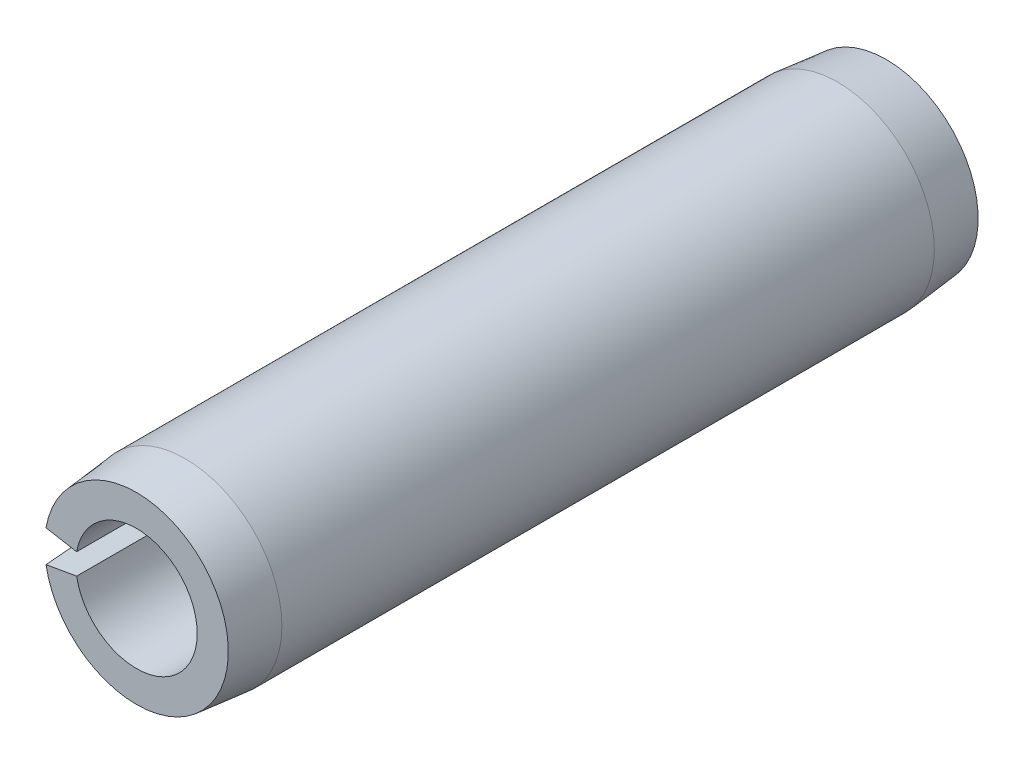
ISO-10303-21;
HEADER;
FILE_DESCRIPTION(('STEP AP214'),'2;1');
FILE_NAME('part.step','',(''),(''),'','','');
FILE_SCHEMA(('AUTOMOTIVE_DESIGN { 1 0 10303 214 1 1 1 1 }'));
ENDSEC;
DATA;
#1=APPLICATION_CONTEXT('core data for automotive mechanical design processes');
#2=APPLICATION_PROTOCOL_DEFINITION('international standard','automotive_design',2000,#1);
#3=PRODUCT_CONTEXT('',#1,'mechanical');
#4=PRODUCT('Part','Part','',(#3));
#5=PRODUCT_RELATED_PRODUCT_CATEGORY('part','',(#4));
#6=PRODUCT_DEFINITION_FORMATION('','',#4);
#7=PRODUCT_DEFINITION_CONTEXT('part definition',#1,'design');
#8=PRODUCT_DEFINITION('design','',#6,#7);
#9=PRODUCT_DEFINITION_SHAPE('','',#8);
#10=(LENGTH_UNIT() NAMED_UNIT(*) SI_UNIT(.MILLI.,.METRE.));
#11=(NAMED_UNIT(*) PLANE_ANGLE_UNIT() SI_UNIT($,.RADIAN.));
#12=(NAMED_UNIT(*) SI_UNIT($,.STERADIAN.) SOLID_ANGLE_UNIT());
#13=UNCERTAINTY_MEASURE_WITH_UNIT(LENGTH_MEASURE(1.E-05),#10,'distance_accuracy_value','');
#14=(GEOMETRIC_REPRESENTATION_CONTEXT(3) GLOBAL_UNCERTAINTY_ASSIGNED_CONTEXT((#13)) GLOBAL_UNIT_ASSIGNED_CONTEXT((#10,
#11,#12)) REPRESENTATION_CONTEXT('',''));
#15=CARTESIAN_POINT('',(0.,0.,0.));
#16=DIRECTION('',(0.,0.,1.));
#17=DIRECTION('',(1.,0.,0.));
#18=AXIS2_PLACEMENT_3D('',#15,#16,#17);
#19=CARTESIAN_POINT('',(0.,0.,12.7));
#20=DIRECTION('',(0.,0.,-1.));
#21=DIRECTION('',(-1.,0.,0.));
#22=AXIS2_PLACEMENT_3D('',#19,#20,#21);
#23=CYLINDRICAL_SURFACE('',#22,2.0574);
#24=CARTESIAN_POINT('',(0.,0.,-12.7));
#25=DIRECTION('',(0.,0.,-1.));
#26=DIRECTION('',(1.,0.,0.));
#27=AXIS2_PLACEMENT_3D('',#24,#25,#26);
#28=CIRCLE('',#27,2.0574);
#29=CARTESIAN_POINT('',(-2.02614347104732,0.357263760731936,-12.7));
#30=VERTEX_POINT('',#29);
#31=CARTESIAN_POINT('',(-2.02614347104732,-0.357263760731936,-12.7));
#32=VERTEX_POINT('',#31);
#33=EDGE_CURVE('E115',#30,#32,#28,.T.);
#34=ORIENTED_EDGE('',*,*,#33,.T.);
#35=DIRECTION('',(0.,0.,-1.));
#36=VECTOR('',#35,1.);
#37=CARTESIAN_POINT('',(-2.02614347104732,-0.357263760731936,12.7));
#38=LINE('',#37,#36);
#39=CARTESIAN_POINT('',(-2.02614347104732,-0.357263760731936,12.7));
#40=VERTEX_POINT('',#39);
#41=EDGE_CURVE('E11',#40,#32,#38,.T.);
#42=ORIENTED_EDGE('',*,*,#41,.F.);
#43=CARTESIAN_POINT('',(0.,0.,12.7));
#44=DIRECTION('',(0.,0.,-1.));
#45=DIRECTION('',(1.,0.,0.));
#46=AXIS2_PLACEMENT_3D('',#43,#44,#45);
#47=CIRCLE('',#46,2.0574);
#48=CARTESIAN_POINT('',(-2.02614347104732,0.357263760731936,12.7));
#49=VERTEX_POINT('',#48);
#50=EDGE_CURVE('E111',#49,#40,#47,.T.);
#51=ORIENTED_EDGE('',*,*,#50,.F.);
#52=DIRECTION('',(0.,0.,-1.));
#53=VECTOR('',#52,1.);
#54=CARTESIAN_POINT('',(-2.02614347104732,0.357263760731936,12.7));
#55=LINE('',#54,#53);
#56=EDGE_CURVE('E104',#49,#30,#55,.T.);
#57=ORIENTED_EDGE('',*,*,#56,.T.);
#58=EDGE_LOOP('',(#34,#42,#51,#57));
#59=FACE_BOUND('',#58,.T.);
#60=ADVANCED_FACE('F32',(#59),#23,.F.);
#61=CARTESIAN_POINT('',(-2.02614347104732,-0.357263760731936,12.7));
#62=DIRECTION('',(0.173648177666928,-0.984807753012209,0.));
#63=DIRECTION('',(0.984807753012209,0.173648177666928,0.));
#64=AXIS2_PLACEMENT_3D('',#61,#62,#63);
#65=PLANE('',#64);
#66=DIRECTION('',(0.,0.,-1.));
#67=VECTOR('',#66,1.);
#68=CARTESIAN_POINT('',(-3.2268210835198,-0.568975618943453,12.7));
#69=LINE('',#68,#67);
#70=CARTESIAN_POINT('',(-3.22682108351981,-0.568975618943454,11.049));
#71=VERTEX_POINT('',#70);
#72=CARTESIAN_POINT('',(-3.22682108351981,-0.568975618943454,-11.049));
#73=VERTEX_POINT('',#72);
#74=EDGE_CURVE('E39',#71,#73,#69,.T.);
#75=ORIENTED_EDGE('',*,*,#74,.F.);
#76=DIRECTION('',(-0.0979920339454284,-0.0172786394790785,-0.995037190209989));
#77=VECTOR('',#76,1.);
#78=CARTESIAN_POINT('',(0.,0.,43.8149999999999));
#79=LINE('',#78,#77);
#80=CARTESIAN_POINT('',(-3.06422932349749,-0.540306304810645,12.7));
#81=VERTEX_POINT('',#80);
#82=EDGE_CURVE('E86',#71,#81,#79,.F.);
#83=ORIENTED_EDGE('',*,*,#82,.T.);
#84=DIRECTION('',(-0.984807753012209,-0.173648177666928,0.));
#85=VECTOR('',#84,1.);
#86=CARTESIAN_POINT('',(-2.02614347104732,-0.357263760731936,12.7));
#87=LINE('',#86,#85);
#88=EDGE_CURVE('E119',#40,#81,#87,.T.);
#89=ORIENTED_EDGE('',*,*,#88,.F.);
#90=ORIENTED_EDGE('',*,*,#41,.T.);
#91=DIRECTION('',(-0.984807753012209,-0.173648177666928,0.));
#92=VECTOR('',#91,1.);
#93=CARTESIAN_POINT('',(-2.02614347104732,-0.357263760731936,-12.7));
#94=LINE('',#93,#92);
#95=CARTESIAN_POINT('',(-3.06422932349749,-0.540306304810645,-12.7));
#96=VERTEX_POINT('',#95);
#97=EDGE_CURVE('E112',#32,#96,#94,.T.);
#98=ORIENTED_EDGE('',*,*,#97,.T.);
#99=DIRECTION('',(0.0979920339454284,0.0172786394790785,-0.995037190209989));
#100=VECTOR('',#99,1.);
#101=CARTESIAN_POINT('',(0.,0.,-43.8149999999999));
#102=LINE('',#101,#100);
#103=EDGE_CURVE('E54',#96,#73,#102,.F.);
#104=ORIENTED_EDGE('',*,*,#103,.T.);
#105=EDGE_LOOP('',(#75,#83,#89,#90,#98,#104));
#106=FACE_BOUND('',#105,.T.);
#107=ADVANCED_FACE('F133',(#106),#65,.F.);
#108=CARTESIAN_POINT('',(0.,0.,12.7));
#109=DIRECTION('',(0.,0.,-1.));
#110=DIRECTION('',(-1.,0.,0.));
#111=AXIS2_PLACEMENT_3D('',#108,#109,#110);
#112=CYLINDRICAL_SURFACE('',#111,3.2766);
#113=DIRECTION('',(0.,0.,-1.));
#114=VECTOR('',#113,1.);
#115=CARTESIAN_POINT('',(-3.2268210835198,0.568975618943454,12.7));
#116=LINE('',#115,#114);
#117=CARTESIAN_POINT('',(-3.22682108351981,0.568975618943455,11.049));
#118=VERTEX_POINT('',#117);
#119=CARTESIAN_POINT('',(-3.22682108351981,0.568975618943455,-11.049));
#120=VERTEX_POINT('',#119);
#121=EDGE_CURVE('E96',#118,#120,#116,.T.);
#122=ORIENTED_EDGE('',*,*,#121,.F.);
#123=CARTESIAN_POINT('',(0.,0.,11.049));
#124=DIRECTION('',(0.,0.,-1.));
#125=DIRECTION('',(-1.,0.,0.));
#126=AXIS2_PLACEMENT_3D('',#123,#124,#125);
#127=CIRCLE('',#126,3.2766);
#128=EDGE_CURVE('E83',#118,#71,#127,.T.);
#129=ORIENTED_EDGE('',*,*,#128,.T.);
#130=ORIENTED_EDGE('',*,*,#74,.T.);
#131=CARTESIAN_POINT('',(0.,0.,-11.049));
#132=DIRECTION('',(0.,0.,-1.));
#133=DIRECTION('',(-1.,0.,0.));
#134=AXIS2_PLACEMENT_3D('',#131,#132,#133);
#135=CIRCLE('',#134,3.2766);
#136=EDGE_CURVE('E103',#120,#73,#135,.T.);
#137=ORIENTED_EDGE('',*,*,#136,.F.);
#138=EDGE_LOOP('',(#122,#129,#130,#137));
#139=FACE_BOUND('',#138,.T.);
#140=ADVANCED_FACE('F102',(#139),#112,.T.);
#141=CARTESIAN_POINT('',(-3.2268210835198,0.568975618943454,12.7));
#142=DIRECTION('',(0.173648177666928,0.984807753012209,0.));
#143=DIRECTION('',(-0.984807753012209,0.173648177666928,0.));
#144=AXIS2_PLACEMENT_3D('',#141,#142,#143);
#145=PLANE('',#144);
#146=DIRECTION('',(0.984807753012209,-0.173648177666928,0.));
#147=VECTOR('',#146,1.);
#148=CARTESIAN_POINT('',(-3.2268210835198,0.568975618943454,12.7));
#149=LINE('',#148,#147);
#150=CARTESIAN_POINT('',(-3.06422932349749,0.540306304810645,12.7));
#151=VERTEX_POINT('',#150);
#152=EDGE_CURVE('E99',#151,#49,#149,.T.);
#153=ORIENTED_EDGE('',*,*,#152,.F.);
#154=DIRECTION('',(0.0979920339454284,-0.0172786394790785,0.995037190209989));
#155=VECTOR('',#154,1.);
#156=CARTESIAN_POINT('',(0.,0.,43.8149999999999));
#157=LINE('',#156,#155);
#158=EDGE_CURVE('E46',#151,#118,#157,.F.);
#159=ORIENTED_EDGE('',*,*,#158,.T.);
#160=ORIENTED_EDGE('',*,*,#121,.T.);
#161=DIRECTION('',(-0.0979920339454284,0.0172786394790785,0.995037190209989));
#162=VECTOR('',#161,1.);
#163=CARTESIAN_POINT('',(0.,0.,-43.8149999999999));
#164=LINE('',#163,#162);
#165=CARTESIAN_POINT('',(-3.06422932349749,0.540306304810645,-12.7));
#166=VERTEX_POINT('',#165);
#167=EDGE_CURVE('E125',#120,#166,#164,.F.);
#168=ORIENTED_EDGE('',*,*,#167,.T.);
#169=DIRECTION('',(0.984807753012209,-0.173648177666928,0.));
#170=VECTOR('',#169,1.);
#171=CARTESIAN_POINT('',(-3.2268210835198,0.568975618943454,-12.7));
#172=LINE('',#171,#170);
#173=EDGE_CURVE('E109',#166,#30,#172,.T.);
#174=ORIENTED_EDGE('',*,*,#173,.T.);
#175=ORIENTED_EDGE('',*,*,#56,.F.);
#176=EDGE_LOOP('',(#153,#159,#160,#168,#174,#175));
#177=FACE_BOUND('',#176,.T.);
#178=ADVANCED_FACE('F94',(#177),#145,.F.);
#179=CARTESIAN_POINT('',(0.,0.,12.7));
#180=DIRECTION('',(0.,0.,1.));
#181=DIRECTION('',(1.,0.,0.));
#182=AXIS2_PLACEMENT_3D('',#179,#180,#181);
#183=PLANE('',#182);
#184=CARTESIAN_POINT('',(0.,0.,12.7));
#185=DIRECTION('',(0.,0.,-1.));
#186=DIRECTION('',(-1.,0.,0.));
#187=AXIS2_PLACEMENT_3D('',#184,#185,#186);
#188=CIRCLE('',#187,3.1115);
#189=EDGE_CURVE('E90',#151,#81,#188,.T.);
#190=ORIENTED_EDGE('',*,*,#189,.F.);
#191=ORIENTED_EDGE('',*,*,#152,.T.);
#192=ORIENTED_EDGE('',*,*,#50,.T.);
#193=ORIENTED_EDGE('',*,*,#88,.T.);
#194=EDGE_LOOP('',(#190,#191,#192,#193));
#195=FACE_BOUND('',#194,.T.);
#196=ADVANCED_FACE('F134',(#195),#183,.T.);
#197=CARTESIAN_POINT('',(0.,0.,-12.7));
#198=DIRECTION('',(0.,0.,1.));
#199=DIRECTION('',(1.,0.,0.));
#200=AXIS2_PLACEMENT_3D('',#197,#198,#199);
#201=PLANE('',#200);
#202=ORIENTED_EDGE('',*,*,#173,.F.);
#203=CARTESIAN_POINT('',(0.,0.,-12.7));
#204=DIRECTION('',(0.,0.,-1.));
#205=DIRECTION('',(-1.,0.,0.));
#206=AXIS2_PLACEMENT_3D('',#203,#204,#205);
#207=CIRCLE('',#206,3.1115);
#208=EDGE_CURVE('E127',#166,#96,#207,.T.);
#209=ORIENTED_EDGE('',*,*,#208,.T.);
#210=ORIENTED_EDGE('',*,*,#97,.F.);
#211=ORIENTED_EDGE('',*,*,#33,.F.);
#212=EDGE_LOOP('',(#202,#209,#210,#211));
#213=FACE_BOUND('',#212,.T.);
#214=ADVANCED_FACE('F141',(#213),#201,.F.);
#215=CARTESIAN_POINT('',(0.,0.,-11.049));
#216=DIRECTION('',(0.,0.,1.));
#217=DIRECTION('',(1.,0.,0.));
#218=AXIS2_PLACEMENT_3D('',#215,#216,#217);
#219=CONICAL_SURFACE('',#218,3.2766,0.0996686524911623);
#220=ORIENTED_EDGE('',*,*,#208,.F.);
#221=ORIENTED_EDGE('',*,*,#167,.F.);
#222=ORIENTED_EDGE('',*,*,#136,.T.);
#223=ORIENTED_EDGE('',*,*,#103,.F.);
#224=EDGE_LOOP('',(#220,#221,#222,#223));
#225=FACE_BOUND('',#224,.T.);
#226=ADVANCED_FACE('F142',(#225),#219,.T.);
#227=CARTESIAN_POINT('',(0.,0.,12.7));
#228=DIRECTION('',(0.,0.,-1.));
#229=DIRECTION('',(-1.,0.,0.));
#230=AXIS2_PLACEMENT_3D('',#227,#228,#229);
#231=CONICAL_SURFACE('',#230,3.1115,0.0996686524911623);
#232=ORIENTED_EDGE('',*,*,#128,.F.);
#233=ORIENTED_EDGE('',*,*,#158,.F.);
#234=ORIENTED_EDGE('',*,*,#189,.T.);
#235=ORIENTED_EDGE('',*,*,#82,.F.);
#236=EDGE_LOOP('',(#232,#233,#234,#235));
#237=FACE_BOUND('',#236,.T.);
#238=ADVANCED_FACE('F84',(#237),#231,.T.);
#239=CLOSED_SHELL('',(#60,#107,#140,#178,#196,#214,#226,#238));
#240=MANIFOLD_SOLID_BREP('B2',#239);
#241=ADVANCED_BREP_SHAPE_REPRESENTATION('',(#18,#240),#14);
#242=SHAPE_DEFINITION_REPRESENTATION(#9,#241);
ENDSEC;
END-ISO-10303-21;
